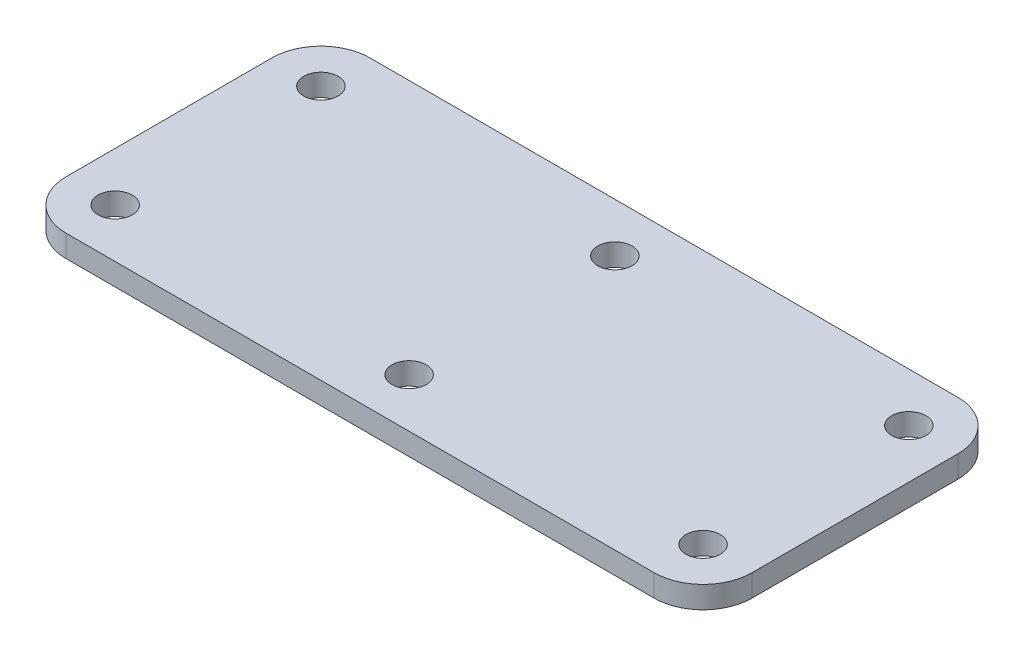
ISO-10303-21;
HEADER;
FILE_DESCRIPTION(('STEP AP214'),'2;1');
FILE_NAME('part.step','',(''),(''),'','','');
FILE_SCHEMA(('AUTOMOTIVE_DESIGN { 1 0 10303 214 1 1 1 1 }'));
ENDSEC;
DATA;
#1=APPLICATION_CONTEXT('core data for automotive mechanical design processes');
#2=APPLICATION_PROTOCOL_DEFINITION('international standard','automotive_design',2000,#1);
#3=PRODUCT_CONTEXT('',#1,'mechanical');
#4=PRODUCT('Part','Part','',(#3));
#5=PRODUCT_RELATED_PRODUCT_CATEGORY('part','',(#4));
#6=PRODUCT_DEFINITION_FORMATION('','',#4);
#7=PRODUCT_DEFINITION_CONTEXT('part definition',#1,'design');
#8=PRODUCT_DEFINITION('design','',#6,#7);
#9=PRODUCT_DEFINITION_SHAPE('','',#8);
#10=(LENGTH_UNIT() NAMED_UNIT(*) SI_UNIT(.MILLI.,.METRE.));
#11=(NAMED_UNIT(*) PLANE_ANGLE_UNIT() SI_UNIT($,.RADIAN.));
#12=(NAMED_UNIT(*) SI_UNIT($,.STERADIAN.) SOLID_ANGLE_UNIT());
#13=UNCERTAINTY_MEASURE_WITH_UNIT(LENGTH_MEASURE(1.E-05),#10,'distance_accuracy_value','');
#14=(GEOMETRIC_REPRESENTATION_CONTEXT(3) GLOBAL_UNCERTAINTY_ASSIGNED_CONTEXT((#13)) GLOBAL_UNIT_ASSIGNED_CONTEXT((#10,
#11,#12)) REPRESENTATION_CONTEXT('',''));
#15=CARTESIAN_POINT('',(0.,0.,0.));
#16=DIRECTION('',(0.,0.,1.));
#17=DIRECTION('',(1.,0.,0.));
#18=AXIS2_PLACEMENT_3D('',#15,#16,#17);
#19=CARTESIAN_POINT('',(-23.7329633323304,4.5,595.150162880876));
#20=DIRECTION('',(0.,1.,0.));
#21=DIRECTION('',(0.,0.,1.));
#22=AXIS2_PLACEMENT_3D('',#19,#20,#21);
#23=PLANE('',#22);
#24=CARTESIAN_POINT('',(96.2670366676696,4.5,595.150162880876));
#25=DIRECTION('',(0.,1.,0.));
#26=DIRECTION('',(0.,0.,1.));
#27=AXIS2_PLACEMENT_3D('',#24,#25,#26);
#28=CIRCLE('',#27,3.49999999999997);
#29=CARTESIAN_POINT('',(96.2670366676696,4.5,598.650162880876));
#30=VERTEX_POINT('',#29);
#31=EDGE_CURVE('E200',#30,#30,#28,.T.);
#32=ORIENTED_EDGE('',*,*,#31,.F.);
#33=EDGE_LOOP('',(#32));
#34=FACE_BOUND('',#33,.T.);
#35=CARTESIAN_POINT('',(-23.7329633323305,4.5,553.150162880876));
#36=DIRECTION('',(0.,1.,0.));
#37=DIRECTION('',(0.,0.,1.));
#38=AXIS2_PLACEMENT_3D('',#35,#36,#37);
#39=CIRCLE('',#38,3.49999999999996);
#40=CARTESIAN_POINT('',(-23.7329633323305,4.5,556.650162880876));
#41=VERTEX_POINT('',#40);
#42=EDGE_CURVE('E188',#41,#41,#39,.T.);
#43=ORIENTED_EDGE('',*,*,#42,.F.);
#44=EDGE_LOOP('',(#43));
#45=FACE_BOUND('',#44,.T.);
#46=CARTESIAN_POINT('',(36.2670366676696,4.5,553.150162880876));
#47=DIRECTION('',(0.,1.,0.));
#48=DIRECTION('',(0.,0.,1.));
#49=AXIS2_PLACEMENT_3D('',#46,#47,#48);
#50=CIRCLE('',#49,3.49999999999997);
#51=CARTESIAN_POINT('',(36.2670366676696,4.5,556.650162880876));
#52=VERTEX_POINT('',#51);
#53=EDGE_CURVE('E134',#52,#52,#50,.T.);
#54=ORIENTED_EDGE('',*,*,#53,.F.);
#55=EDGE_LOOP('',(#54));
#56=FACE_BOUND('',#55,.T.);
#57=CARTESIAN_POINT('',(-23.7329633323304,4.5,595.150162880876));
#58=DIRECTION('',(0.,1.,0.));
#59=DIRECTION('',(0.,0.,1.));
#60=AXIS2_PLACEMENT_3D('',#57,#58,#59);
#61=CIRCLE('',#60,10.);
#62=CARTESIAN_POINT('',(-33.7329633323304,4.5,595.150162880876));
#63=VERTEX_POINT('',#62);
#64=CARTESIAN_POINT('',(-23.7329633323304,4.5,605.150162880876));
#65=VERTEX_POINT('',#64);
#66=EDGE_CURVE('E145',#63,#65,#61,.T.);
#67=ORIENTED_EDGE('',*,*,#66,.T.);
#68=DIRECTION('',(1.,0.,0.));
#69=VECTOR('',#68,1.);
#70=CARTESIAN_POINT('',(-23.7329633323304,4.5,605.150162880876));
#71=LINE('',#70,#69);
#72=CARTESIAN_POINT('',(96.2670366676696,4.5,605.150162880876));
#73=VERTEX_POINT('',#72);
#74=EDGE_CURVE('E93',#65,#73,#71,.T.);
#75=ORIENTED_EDGE('',*,*,#74,.T.);
#76=CARTESIAN_POINT('',(96.2670366676696,4.5,595.150162880876));
#77=DIRECTION('',(0.,1.,0.));
#78=DIRECTION('',(0.,0.,1.));
#79=AXIS2_PLACEMENT_3D('',#76,#77,#78);
#80=CIRCLE('',#79,10.);
#81=CARTESIAN_POINT('',(106.26703666767,4.5,595.150162880876));
#82=VERTEX_POINT('',#81);
#83=EDGE_CURVE('E160',#73,#82,#80,.T.);
#84=ORIENTED_EDGE('',*,*,#83,.T.);
#85=DIRECTION('',(0.,0.,-1.));
#86=VECTOR('',#85,1.);
#87=CARTESIAN_POINT('',(106.26703666767,4.5,553.150162880876));
#88=LINE('',#87,#86);
#89=CARTESIAN_POINT('',(106.26703666767,4.5,553.150162880876));
#90=VERTEX_POINT('',#89);
#91=EDGE_CURVE('E173',#82,#90,#88,.T.);
#92=ORIENTED_EDGE('',*,*,#91,.T.);
#93=CARTESIAN_POINT('',(96.2670366676696,4.5,553.150162880876));
#94=DIRECTION('',(0.,1.,0.));
#95=DIRECTION('',(0.,0.,-1.));
#96=AXIS2_PLACEMENT_3D('',#93,#94,#95);
#97=CIRCLE('',#96,10.);
#98=CARTESIAN_POINT('',(96.2670366676696,4.5,543.150162880876));
#99=VERTEX_POINT('',#98);
#100=EDGE_CURVE('E112',#90,#99,#97,.T.);
#101=ORIENTED_EDGE('',*,*,#100,.T.);
#102=DIRECTION('',(-1.,0.,0.));
#103=VECTOR('',#102,1.);
#104=CARTESIAN_POINT('',(-23.7329633323304,4.5,543.150162880876));
#105=LINE('',#104,#103);
#106=CARTESIAN_POINT('',(-23.7329633323304,4.5,543.150162880876));
#107=VERTEX_POINT('',#106);
#108=EDGE_CURVE('E106',#99,#107,#105,.T.);
#109=ORIENTED_EDGE('',*,*,#108,.T.);
#110=CARTESIAN_POINT('',(-23.7329633323305,4.5,553.150162880876));
#111=DIRECTION('',(0.,1.,0.));
#112=DIRECTION('',(0.,0.,1.));
#113=AXIS2_PLACEMENT_3D('',#110,#111,#112);
#114=CIRCLE('',#113,10.);
#115=CARTESIAN_POINT('',(-33.7329633323305,4.5,553.150162880876));
#116=VERTEX_POINT('',#115);
#117=EDGE_CURVE('E110',#107,#116,#114,.T.);
#118=ORIENTED_EDGE('',*,*,#117,.T.);
#119=DIRECTION('',(0.,0.,1.));
#120=VECTOR('',#119,1.);
#121=CARTESIAN_POINT('',(-33.7329633323305,4.5,553.150162880876));
#122=LINE('',#121,#120);
#123=EDGE_CURVE('E50',#116,#63,#122,.T.);
#124=ORIENTED_EDGE('',*,*,#123,.T.);
#125=EDGE_LOOP('',(#67,#75,#84,#92,#101,#109,#118,#124));
#126=FACE_BOUND('',#125,.T.);
#127=CARTESIAN_POINT('',(96.2670366676695,4.5,553.150162880876));
#128=DIRECTION('',(0.,1.,0.));
#129=DIRECTION('',(0.,0.,1.));
#130=AXIS2_PLACEMENT_3D('',#127,#128,#129);
#131=CIRCLE('',#130,3.49999999999997);
#132=CARTESIAN_POINT('',(96.2670366676695,4.5,556.650162880876));
#133=VERTEX_POINT('',#132);
#134=EDGE_CURVE('E182',#133,#133,#131,.T.);
#135=ORIENTED_EDGE('',*,*,#134,.F.);
#136=EDGE_LOOP('',(#135));
#137=FACE_BOUND('',#136,.T.);
#138=CARTESIAN_POINT('',(36.2670366676696,4.5,595.150162880876));
#139=DIRECTION('',(0.,1.,0.));
#140=DIRECTION('',(0.,0.,1.));
#141=AXIS2_PLACEMENT_3D('',#138,#139,#140);
#142=CIRCLE('',#141,3.49999999999997);
#143=CARTESIAN_POINT('',(36.2670366676696,4.5,598.650162880876));
#144=VERTEX_POINT('',#143);
#145=EDGE_CURVE('E194',#144,#144,#142,.T.);
#146=ORIENTED_EDGE('',*,*,#145,.F.);
#147=EDGE_LOOP('',(#146));
#148=FACE_BOUND('',#147,.T.);
#149=CARTESIAN_POINT('',(-23.7329633323304,4.5,595.150162880876));
#150=DIRECTION('',(0.,1.,0.));
#151=DIRECTION('',(0.,0.,1.));
#152=AXIS2_PLACEMENT_3D('',#149,#150,#151);
#153=CIRCLE('',#152,3.49999999999996);
#154=CARTESIAN_POINT('',(-23.7329633323304,4.5,598.650162880876));
#155=VERTEX_POINT('',#154);
#156=EDGE_CURVE('E206',#155,#155,#153,.T.);
#157=ORIENTED_EDGE('',*,*,#156,.F.);
#158=EDGE_LOOP('',(#157));
#159=FACE_BOUND('',#158,.T.);
#160=ADVANCED_FACE('F33',(#34,#45,#56,#126,#137,#148,#159),#23,.T.);
#161=CARTESIAN_POINT('',(-23.7329633323304,0.,595.150162880876));
#162=DIRECTION('',(0.,1.,0.));
#163=DIRECTION('',(0.,0.,1.));
#164=AXIS2_PLACEMENT_3D('',#161,#162,#163);
#165=PLANE('',#164);
#166=CARTESIAN_POINT('',(-23.7329633323304,0.,595.150162880876));
#167=DIRECTION('',(0.,1.,0.));
#168=DIRECTION('',(0.,0.,1.));
#169=AXIS2_PLACEMENT_3D('',#166,#167,#168);
#170=CIRCLE('',#169,10.);
#171=CARTESIAN_POINT('',(-33.7329633323304,0.,595.150162880876));
#172=VERTEX_POINT('',#171);
#173=CARTESIAN_POINT('',(-23.7329633323304,0.,605.150162880876));
#174=VERTEX_POINT('',#173);
#175=EDGE_CURVE('E130',#172,#174,#170,.T.);
#176=ORIENTED_EDGE('',*,*,#175,.F.);
#177=DIRECTION('',(0.,0.,1.));
#178=VECTOR('',#177,1.);
#179=CARTESIAN_POINT('',(-33.7329633323305,0.,553.150162880876));
#180=LINE('',#179,#178);
#181=CARTESIAN_POINT('',(-33.7329633323305,0.,553.150162880876));
#182=VERTEX_POINT('',#181);
#183=EDGE_CURVE('E85',#182,#172,#180,.T.);
#184=ORIENTED_EDGE('',*,*,#183,.F.);
#185=CARTESIAN_POINT('',(-23.7329633323305,0.,553.150162880876));
#186=DIRECTION('',(0.,1.,0.));
#187=DIRECTION('',(0.,0.,1.));
#188=AXIS2_PLACEMENT_3D('',#185,#186,#187);
#189=CIRCLE('',#188,10.);
#190=CARTESIAN_POINT('',(-23.7329633323304,0.,543.150162880876));
#191=VERTEX_POINT('',#190);
#192=EDGE_CURVE('E79',#191,#182,#189,.T.);
#193=ORIENTED_EDGE('',*,*,#192,.F.);
#194=DIRECTION('',(-1.,0.,0.));
#195=VECTOR('',#194,1.);
#196=CARTESIAN_POINT('',(-23.7329633323304,0.,543.150162880876));
#197=LINE('',#196,#195);
#198=CARTESIAN_POINT('',(96.2670366676696,0.,543.150162880876));
#199=VERTEX_POINT('',#198);
#200=EDGE_CURVE('E120',#199,#191,#197,.T.);
#201=ORIENTED_EDGE('',*,*,#200,.F.);
#202=CARTESIAN_POINT('',(96.2670366676696,0.,553.150162880876));
#203=DIRECTION('',(0.,1.,0.));
#204=DIRECTION('',(0.,0.,-1.));
#205=AXIS2_PLACEMENT_3D('',#202,#203,#204);
#206=CIRCLE('',#205,10.);
#207=CARTESIAN_POINT('',(106.26703666767,0.,553.150162880876));
#208=VERTEX_POINT('',#207);
#209=EDGE_CURVE('E140',#208,#199,#206,.T.);
#210=ORIENTED_EDGE('',*,*,#209,.F.);
#211=DIRECTION('',(0.,0.,-1.));
#212=VECTOR('',#211,1.);
#213=CARTESIAN_POINT('',(106.26703666767,0.,553.150162880876));
#214=LINE('',#213,#212);
#215=CARTESIAN_POINT('',(106.26703666767,0.,595.150162880876));
#216=VERTEX_POINT('',#215);
#217=EDGE_CURVE('E138',#216,#208,#214,.T.);
#218=ORIENTED_EDGE('',*,*,#217,.F.);
#219=CARTESIAN_POINT('',(96.2670366676696,0.,595.150162880876));
#220=DIRECTION('',(0.,1.,0.));
#221=DIRECTION('',(0.,0.,1.));
#222=AXIS2_PLACEMENT_3D('',#219,#220,#221);
#223=CIRCLE('',#222,10.);
#224=CARTESIAN_POINT('',(96.2670366676696,0.,605.150162880876));
#225=VERTEX_POINT('',#224);
#226=EDGE_CURVE('E136',#225,#216,#223,.T.);
#227=ORIENTED_EDGE('',*,*,#226,.F.);
#228=DIRECTION('',(1.,0.,0.));
#229=VECTOR('',#228,1.);
#230=CARTESIAN_POINT('',(-23.7329633323304,0.,605.150162880876));
#231=LINE('',#230,#229);
#232=EDGE_CURVE('E133',#174,#225,#231,.T.);
#233=ORIENTED_EDGE('',*,*,#232,.F.);
#234=EDGE_LOOP('',(#176,#184,#193,#201,#210,#218,#227,#233));
#235=FACE_BOUND('',#234,.T.);
#236=CARTESIAN_POINT('',(36.2670366676696,0.,553.150162880876));
#237=DIRECTION('',(0.,1.,0.));
#238=DIRECTION('',(0.,0.,1.));
#239=AXIS2_PLACEMENT_3D('',#236,#237,#238);
#240=CIRCLE('',#239,3.49999999999997);
#241=CARTESIAN_POINT('',(36.2670366676696,0.,556.650162880876));
#242=VERTEX_POINT('',#241);
#243=EDGE_CURVE('E179',#242,#242,#240,.T.);
#244=ORIENTED_EDGE('',*,*,#243,.T.);
#245=EDGE_LOOP('',(#244));
#246=FACE_BOUND('',#245,.T.);
#247=CARTESIAN_POINT('',(96.2670366676695,0.,553.150162880876));
#248=DIRECTION('',(0.,1.,0.));
#249=DIRECTION('',(0.,0.,1.));
#250=AXIS2_PLACEMENT_3D('',#247,#248,#249);
#251=CIRCLE('',#250,3.49999999999997);
#252=CARTESIAN_POINT('',(96.2670366676695,0.,556.650162880876));
#253=VERTEX_POINT('',#252);
#254=EDGE_CURVE('E185',#253,#253,#251,.T.);
#255=ORIENTED_EDGE('',*,*,#254,.T.);
#256=EDGE_LOOP('',(#255));
#257=FACE_BOUND('',#256,.T.);
#258=CARTESIAN_POINT('',(-23.7329633323305,0.,553.150162880876));
#259=DIRECTION('',(0.,1.,0.));
#260=DIRECTION('',(0.,0.,1.));
#261=AXIS2_PLACEMENT_3D('',#258,#259,#260);
#262=CIRCLE('',#261,3.49999999999996);
#263=CARTESIAN_POINT('',(-23.7329633323305,0.,556.650162880876));
#264=VERTEX_POINT('',#263);
#265=EDGE_CURVE('E191',#264,#264,#262,.T.);
#266=ORIENTED_EDGE('',*,*,#265,.T.);
#267=EDGE_LOOP('',(#266));
#268=FACE_BOUND('',#267,.T.);
#269=CARTESIAN_POINT('',(36.2670366676696,0.,595.150162880876));
#270=DIRECTION('',(0.,1.,0.));
#271=DIRECTION('',(0.,0.,1.));
#272=AXIS2_PLACEMENT_3D('',#269,#270,#271);
#273=CIRCLE('',#272,3.49999999999997);
#274=CARTESIAN_POINT('',(36.2670366676696,0.,598.650162880876));
#275=VERTEX_POINT('',#274);
#276=EDGE_CURVE('E197',#275,#275,#273,.T.);
#277=ORIENTED_EDGE('',*,*,#276,.T.);
#278=EDGE_LOOP('',(#277));
#279=FACE_BOUND('',#278,.T.);
#280=CARTESIAN_POINT('',(96.2670366676696,0.,595.150162880876));
#281=DIRECTION('',(0.,1.,0.));
#282=DIRECTION('',(0.,0.,1.));
#283=AXIS2_PLACEMENT_3D('',#280,#281,#282);
#284=CIRCLE('',#283,3.49999999999997);
#285=CARTESIAN_POINT('',(96.2670366676696,0.,598.650162880876));
#286=VERTEX_POINT('',#285);
#287=EDGE_CURVE('E203',#286,#286,#284,.T.);
#288=ORIENTED_EDGE('',*,*,#287,.T.);
#289=EDGE_LOOP('',(#288));
#290=FACE_BOUND('',#289,.T.);
#291=CARTESIAN_POINT('',(-23.7329633323304,0.,595.150162880876));
#292=DIRECTION('',(0.,1.,0.));
#293=DIRECTION('',(0.,0.,1.));
#294=AXIS2_PLACEMENT_3D('',#291,#292,#293);
#295=CIRCLE('',#294,3.49999999999996);
#296=CARTESIAN_POINT('',(-23.7329633323304,0.,598.650162880876));
#297=VERTEX_POINT('',#296);
#298=EDGE_CURVE('E209',#297,#297,#295,.T.);
#299=ORIENTED_EDGE('',*,*,#298,.T.);
#300=EDGE_LOOP('',(#299));
#301=FACE_BOUND('',#300,.T.);
#302=ADVANCED_FACE('F164',(#235,#246,#257,#268,#279,#290,#301),#165,.F.);
#303=CARTESIAN_POINT('',(-23.7329633323304,4.5,595.150162880876));
#304=DIRECTION('',(0.,-1.,0.));
#305=DIRECTION('',(0.,0.,-1.));
#306=AXIS2_PLACEMENT_3D('',#303,#304,#305);
#307=CYLINDRICAL_SURFACE('',#306,10.);
#308=ORIENTED_EDGE('',*,*,#175,.T.);
#309=DIRECTION('',(0.,-1.,0.));
#310=VECTOR('',#309,1.);
#311=CARTESIAN_POINT('',(-23.7329633323304,4.5,605.150162880876));
#312=LINE('',#311,#310);
#313=EDGE_CURVE('E11',#65,#174,#312,.T.);
#314=ORIENTED_EDGE('',*,*,#313,.F.);
#315=ORIENTED_EDGE('',*,*,#66,.F.);
#316=DIRECTION('',(0.,-1.,0.));
#317=VECTOR('',#316,1.);
#318=CARTESIAN_POINT('',(-33.7329633323304,4.5,595.150162880876));
#319=LINE('',#318,#317);
#320=EDGE_CURVE('E126',#63,#172,#319,.T.);
#321=ORIENTED_EDGE('',*,*,#320,.T.);
#322=EDGE_LOOP('',(#308,#314,#315,#321));
#323=FACE_BOUND('',#322,.T.);
#324=ADVANCED_FACE('F35',(#323),#307,.T.);
#325=CARTESIAN_POINT('',(-23.7329633323304,4.5,605.150162880876));
#326=DIRECTION('',(0.,0.,-1.));
#327=DIRECTION('',(-1.,0.,0.));
#328=AXIS2_PLACEMENT_3D('',#325,#326,#327);
#329=PLANE('',#328);
#330=ORIENTED_EDGE('',*,*,#232,.T.);
#331=DIRECTION('',(0.,-1.,0.));
#332=VECTOR('',#331,1.);
#333=CARTESIAN_POINT('',(96.2670366676696,4.5,605.150162880876));
#334=LINE('',#333,#332);
#335=EDGE_CURVE('E42',#73,#225,#334,.T.);
#336=ORIENTED_EDGE('',*,*,#335,.F.);
#337=ORIENTED_EDGE('',*,*,#74,.F.);
#338=ORIENTED_EDGE('',*,*,#313,.T.);
#339=EDGE_LOOP('',(#330,#336,#337,#338));
#340=FACE_BOUND('',#339,.T.);
#341=ADVANCED_FACE('F243',(#340),#329,.F.);
#342=CARTESIAN_POINT('',(96.2670366676696,4.5,595.150162880876));
#343=DIRECTION('',(0.,-1.,0.));
#344=DIRECTION('',(0.,0.,-1.));
#345=AXIS2_PLACEMENT_3D('',#342,#343,#344);
#346=CYLINDRICAL_SURFACE('',#345,10.);
#347=ORIENTED_EDGE('',*,*,#226,.T.);
#348=DIRECTION('',(0.,-1.,0.));
#349=VECTOR('',#348,1.);
#350=CARTESIAN_POINT('',(106.26703666767,4.5,595.150162880876));
#351=LINE('',#350,#349);
#352=EDGE_CURVE('E152',#82,#216,#351,.T.);
#353=ORIENTED_EDGE('',*,*,#352,.F.);
#354=ORIENTED_EDGE('',*,*,#83,.F.);
#355=ORIENTED_EDGE('',*,*,#335,.T.);
#356=EDGE_LOOP('',(#347,#353,#354,#355));
#357=FACE_BOUND('',#356,.T.);
#358=ADVANCED_FACE('F158',(#357),#346,.T.);
#359=CARTESIAN_POINT('',(106.26703666767,4.5,553.150162880876));
#360=DIRECTION('',(-1.,0.,0.));
#361=DIRECTION('',(0.,0.,1.));
#362=AXIS2_PLACEMENT_3D('',#359,#360,#361);
#363=PLANE('',#362);
#364=ORIENTED_EDGE('',*,*,#217,.T.);
#365=DIRECTION('',(0.,-1.,0.));
#366=VECTOR('',#365,1.);
#367=CARTESIAN_POINT('',(106.26703666767,4.5,553.150162880876));
#368=LINE('',#367,#366);
#369=EDGE_CURVE('E149',#90,#208,#368,.T.);
#370=ORIENTED_EDGE('',*,*,#369,.F.);
#371=ORIENTED_EDGE('',*,*,#91,.F.);
#372=ORIENTED_EDGE('',*,*,#352,.T.);
#373=EDGE_LOOP('',(#364,#370,#371,#372));
#374=FACE_BOUND('',#373,.T.);
#375=ADVANCED_FACE('F169',(#374),#363,.F.);
#376=CARTESIAN_POINT('',(96.2670366676696,4.5,553.150162880876));
#377=DIRECTION('',(0.,-1.,0.));
#378=DIRECTION('',(0.,0.,-1.));
#379=AXIS2_PLACEMENT_3D('',#376,#377,#378);
#380=CYLINDRICAL_SURFACE('',#379,10.);
#381=ORIENTED_EDGE('',*,*,#209,.T.);
#382=DIRECTION('',(0.,-1.,0.));
#383=VECTOR('',#382,1.);
#384=CARTESIAN_POINT('',(96.2670366676696,4.5,543.150162880876));
#385=LINE('',#384,#383);
#386=EDGE_CURVE('E121',#99,#199,#385,.T.);
#387=ORIENTED_EDGE('',*,*,#386,.F.);
#388=ORIENTED_EDGE('',*,*,#100,.F.);
#389=ORIENTED_EDGE('',*,*,#369,.T.);
#390=EDGE_LOOP('',(#381,#387,#388,#389));
#391=FACE_BOUND('',#390,.T.);
#392=ADVANCED_FACE('F172',(#391),#380,.T.);
#393=CARTESIAN_POINT('',(-23.7329633323304,4.5,543.150162880876));
#394=DIRECTION('',(0.,0.,1.));
#395=DIRECTION('',(1.,0.,0.));
#396=AXIS2_PLACEMENT_3D('',#393,#394,#395);
#397=PLANE('',#396);
#398=ORIENTED_EDGE('',*,*,#200,.T.);
#399=DIRECTION('',(0.,-1.,0.));
#400=VECTOR('',#399,1.);
#401=CARTESIAN_POINT('',(-23.7329633323304,4.5,543.150162880876));
#402=LINE('',#401,#400);
#403=EDGE_CURVE('E117',#107,#191,#402,.T.);
#404=ORIENTED_EDGE('',*,*,#403,.F.);
#405=ORIENTED_EDGE('',*,*,#108,.F.);
#406=ORIENTED_EDGE('',*,*,#386,.T.);
#407=EDGE_LOOP('',(#398,#404,#405,#406));
#408=FACE_BOUND('',#407,.T.);
#409=ADVANCED_FACE('F118',(#408),#397,.F.);
#410=CARTESIAN_POINT('',(-23.7329633323305,4.5,553.150162880876));
#411=DIRECTION('',(0.,-1.,0.));
#412=DIRECTION('',(0.,0.,-1.));
#413=AXIS2_PLACEMENT_3D('',#410,#411,#412);
#414=CYLINDRICAL_SURFACE('',#413,10.);
#415=ORIENTED_EDGE('',*,*,#192,.T.);
#416=DIRECTION('',(0.,-1.,0.));
#417=VECTOR('',#416,1.);
#418=CARTESIAN_POINT('',(-33.7329633323305,4.5,553.150162880876));
#419=LINE('',#418,#417);
#420=EDGE_CURVE('E122',#116,#182,#419,.T.);
#421=ORIENTED_EDGE('',*,*,#420,.F.);
#422=ORIENTED_EDGE('',*,*,#117,.F.);
#423=ORIENTED_EDGE('',*,*,#403,.T.);
#424=EDGE_LOOP('',(#415,#421,#422,#423));
#425=FACE_BOUND('',#424,.T.);
#426=ADVANCED_FACE('F124',(#425),#414,.T.);
#427=CARTESIAN_POINT('',(-33.7329633323305,4.5,553.150162880876));
#428=DIRECTION('',(1.,0.,0.));
#429=DIRECTION('',(0.,0.,-1.));
#430=AXIS2_PLACEMENT_3D('',#427,#428,#429);
#431=PLANE('',#430);
#432=ORIENTED_EDGE('',*,*,#183,.T.);
#433=ORIENTED_EDGE('',*,*,#320,.F.);
#434=ORIENTED_EDGE('',*,*,#123,.F.);
#435=ORIENTED_EDGE('',*,*,#420,.T.);
#436=EDGE_LOOP('',(#432,#433,#434,#435));
#437=FACE_BOUND('',#436,.T.);
#438=ADVANCED_FACE('F231',(#437),#431,.F.);
#439=CARTESIAN_POINT('',(36.2670366676696,4.5,553.150162880876));
#440=DIRECTION('',(0.,-1.,0.));
#441=DIRECTION('',(0.,0.,-1.));
#442=AXIS2_PLACEMENT_3D('',#439,#440,#441);
#443=CYLINDRICAL_SURFACE('',#442,3.49999999999997);
#444=ORIENTED_EDGE('',*,*,#53,.T.);
#445=EDGE_LOOP('',(#444));
#446=FACE_BOUND('',#445,.T.);
#447=ORIENTED_EDGE('',*,*,#243,.F.);
#448=EDGE_LOOP('',(#447));
#449=FACE_BOUND('',#448,.T.);
#450=ADVANCED_FACE('F228',(#446,#449),#443,.F.);
#451=CARTESIAN_POINT('',(96.2670366676695,4.5,553.150162880876));
#452=DIRECTION('',(0.,-1.,0.));
#453=DIRECTION('',(0.,0.,-1.));
#454=AXIS2_PLACEMENT_3D('',#451,#452,#453);
#455=CYLINDRICAL_SURFACE('',#454,3.49999999999997);
#456=ORIENTED_EDGE('',*,*,#134,.T.);
#457=EDGE_LOOP('',(#456));
#458=FACE_BOUND('',#457,.T.);
#459=ORIENTED_EDGE('',*,*,#254,.F.);
#460=EDGE_LOOP('',(#459));
#461=FACE_BOUND('',#460,.T.);
#462=ADVANCED_FACE('F307',(#458,#461),#455,.F.);
#463=CARTESIAN_POINT('',(-23.7329633323305,4.5,553.150162880876));
#464=DIRECTION('',(0.,-1.,0.));
#465=DIRECTION('',(0.,0.,-1.));
#466=AXIS2_PLACEMENT_3D('',#463,#464,#465);
#467=CYLINDRICAL_SURFACE('',#466,3.49999999999996);
#468=ORIENTED_EDGE('',*,*,#42,.T.);
#469=EDGE_LOOP('',(#468));
#470=FACE_BOUND('',#469,.T.);
#471=ORIENTED_EDGE('',*,*,#265,.F.);
#472=EDGE_LOOP('',(#471));
#473=FACE_BOUND('',#472,.T.);
#474=ADVANCED_FACE('F315',(#470,#473),#467,.F.);
#475=CARTESIAN_POINT('',(36.2670366676696,4.5,595.150162880876));
#476=DIRECTION('',(0.,-1.,0.));
#477=DIRECTION('',(0.,0.,-1.));
#478=AXIS2_PLACEMENT_3D('',#475,#476,#477);
#479=CYLINDRICAL_SURFACE('',#478,3.49999999999997);
#480=ORIENTED_EDGE('',*,*,#145,.T.);
#481=EDGE_LOOP('',(#480));
#482=FACE_BOUND('',#481,.T.);
#483=ORIENTED_EDGE('',*,*,#276,.F.);
#484=EDGE_LOOP('',(#483));
#485=FACE_BOUND('',#484,.T.);
#486=ADVANCED_FACE('F323',(#482,#485),#479,.F.);
#487=CARTESIAN_POINT('',(96.2670366676696,4.5,595.150162880876));
#488=DIRECTION('',(0.,-1.,0.));
#489=DIRECTION('',(0.,0.,-1.));
#490=AXIS2_PLACEMENT_3D('',#487,#488,#489);
#491=CYLINDRICAL_SURFACE('',#490,3.49999999999997);
#492=ORIENTED_EDGE('',*,*,#31,.T.);
#493=EDGE_LOOP('',(#492));
#494=FACE_BOUND('',#493,.T.);
#495=ORIENTED_EDGE('',*,*,#287,.F.);
#496=EDGE_LOOP('',(#495));
#497=FACE_BOUND('',#496,.T.);
#498=ADVANCED_FACE('F332',(#494,#497),#491,.F.);
#499=CARTESIAN_POINT('',(-23.7329633323304,4.5,595.150162880876));
#500=DIRECTION('',(0.,-1.,0.));
#501=DIRECTION('',(0.,0.,-1.));
#502=AXIS2_PLACEMENT_3D('',#499,#500,#501);
#503=CYLINDRICAL_SURFACE('',#502,3.49999999999996);
#504=ORIENTED_EDGE('',*,*,#156,.T.);
#505=EDGE_LOOP('',(#504));
#506=FACE_BOUND('',#505,.T.);
#507=ORIENTED_EDGE('',*,*,#298,.F.);
#508=EDGE_LOOP('',(#507));
#509=FACE_BOUND('',#508,.T.);
#510=ADVANCED_FACE('F215',(#506,#509),#503,.F.);
#511=CLOSED_SHELL('',(#160,#302,#324,#341,#358,#375,#392,#409,#426,#438,#450,#462,#474,#486,
#498,#510));
#512=MANIFOLD_SOLID_BREP('B2',#511);
#513=ADVANCED_BREP_SHAPE_REPRESENTATION('',(#18,#512),#14);
#514=SHAPE_DEFINITION_REPRESENTATION(#9,#513);
ENDSEC;
END-ISO-10303-21;
